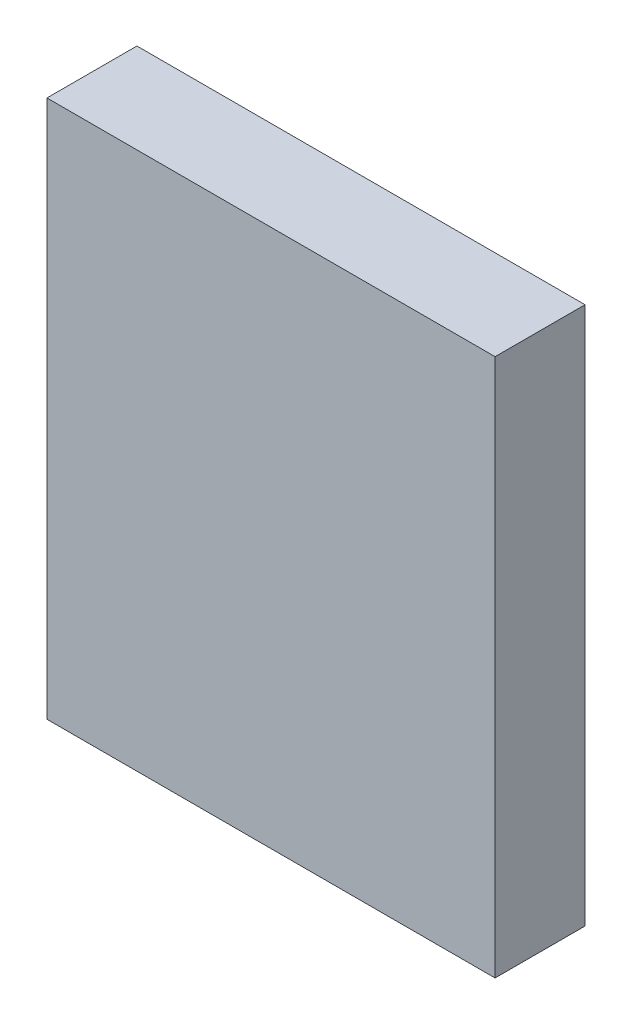
ISO-10303-21;
HEADER;
FILE_DESCRIPTION(('STEP AP214'),'2;1');
FILE_NAME('part.step','',(''),(''),'','','');
FILE_SCHEMA(('AUTOMOTIVE_DESIGN { 1 0 10303 214 1 1 1 1 }'));
ENDSEC;
DATA;
#1=APPLICATION_CONTEXT('core data for automotive mechanical design processes');
#2=APPLICATION_PROTOCOL_DEFINITION('international standard','automotive_design',2000,#1);
#3=PRODUCT_CONTEXT('',#1,'mechanical');
#4=PRODUCT('Part','Part','',(#3));
#5=PRODUCT_RELATED_PRODUCT_CATEGORY('part','',(#4));
#6=PRODUCT_DEFINITION_FORMATION('','',#4);
#7=PRODUCT_DEFINITION_CONTEXT('part definition',#1,'design');
#8=PRODUCT_DEFINITION('design','',#6,#7);
#9=PRODUCT_DEFINITION_SHAPE('','',#8);
#10=(LENGTH_UNIT() NAMED_UNIT(*) SI_UNIT(.MILLI.,.METRE.));
#11=(NAMED_UNIT(*) PLANE_ANGLE_UNIT() SI_UNIT($,.RADIAN.));
#12=(NAMED_UNIT(*) SI_UNIT($,.STERADIAN.) SOLID_ANGLE_UNIT());
#13=UNCERTAINTY_MEASURE_WITH_UNIT(LENGTH_MEASURE(1.E-05),#10,'distance_accuracy_value','');
#14=(GEOMETRIC_REPRESENTATION_CONTEXT(3) GLOBAL_UNCERTAINTY_ASSIGNED_CONTEXT((#13)) GLOBAL_UNIT_ASSIGNED_CONTEXT((#10,
#11,#12)) REPRESENTATION_CONTEXT('',''));
#15=CARTESIAN_POINT('',(0.,0.,0.));
#16=DIRECTION('',(0.,0.,1.));
#17=DIRECTION('',(1.,0.,0.));
#18=AXIS2_PLACEMENT_3D('',#15,#16,#17);
#19=CARTESIAN_POINT('',(-0.627,-1.003,0.));
#20=DIRECTION('',(0.,-1.,0.));
#21=DIRECTION('',(0.,0.,1.));
#22=AXIS2_PLACEMENT_3D('',#19,#20,#21);
#23=PLANE('',#22);
#24=DIRECTION('',(-1.,0.,0.));
#25=VECTOR('',#24,1.);
#26=CARTESIAN_POINT('',(-0.373,-1.003,0.));
#27=LINE('',#26,#25);
#28=CARTESIAN_POINT('',(-0.373,-1.003,0.));
#29=VERTEX_POINT('',#28);
#30=CARTESIAN_POINT('',(-0.627,-1.003,0.));
#31=VERTEX_POINT('',#30);
#32=EDGE_CURVE('E11',#29,#31,#27,.T.);
#33=ORIENTED_EDGE('',*,*,#32,.F.);
#34=DIRECTION('',(0.,0.,-1.));
#35=VECTOR('',#34,1.);
#36=CARTESIAN_POINT('',(-0.373,-1.003,0.051));
#37=LINE('',#36,#35);
#38=CARTESIAN_POINT('',(-0.373,-1.003,0.051));
#39=VERTEX_POINT('',#38);
#40=EDGE_CURVE('E24',#39,#29,#37,.T.);
#41=ORIENTED_EDGE('',*,*,#40,.F.);
#42=DIRECTION('',(1.,0.,0.));
#43=VECTOR('',#42,1.);
#44=CARTESIAN_POINT('',(-0.627,-1.003,0.051));
#45=LINE('',#44,#43);
#46=CARTESIAN_POINT('',(-0.627,-1.003,0.051));
#47=VERTEX_POINT('',#46);
#48=EDGE_CURVE('E88',#47,#39,#45,.T.);
#49=ORIENTED_EDGE('',*,*,#48,.F.);
#50=DIRECTION('',(0.,0.,1.));
#51=VECTOR('',#50,1.);
#52=CARTESIAN_POINT('',(-0.627,-1.003,0.));
#53=LINE('',#52,#51);
#54=EDGE_CURVE('E77',#31,#47,#53,.T.);
#55=ORIENTED_EDGE('',*,*,#54,.F.);
#56=EDGE_LOOP('',(#33,#41,#49,#55));
#57=FACE_BOUND('',#56,.T.);
#58=ADVANCED_FACE('F17',(#57),#23,.T.);
#59=CARTESIAN_POINT('',(-0.373,-1.003,0.));
#60=DIRECTION('',(1.,0.,0.));
#61=DIRECTION('',(0.,0.,1.));
#62=AXIS2_PLACEMENT_3D('',#59,#60,#61);
#63=PLANE('',#62);
#64=DIRECTION('',(0.,-1.,0.));
#65=VECTOR('',#64,1.);
#66=CARTESIAN_POINT('',(-0.373,-0.698,0.));
#67=LINE('',#66,#65);
#68=CARTESIAN_POINT('',(-0.373,-0.698,0.));
#69=VERTEX_POINT('',#68);
#70=EDGE_CURVE('E85',#69,#29,#67,.T.);
#71=ORIENTED_EDGE('',*,*,#70,.F.);
#72=DIRECTION('',(0.,0.,-1.));
#73=VECTOR('',#72,1.);
#74=CARTESIAN_POINT('',(-0.373,-0.698,0.051));
#75=LINE('',#74,#73);
#76=CARTESIAN_POINT('',(-0.373,-0.698,0.051));
#77=VERTEX_POINT('',#76);
#78=EDGE_CURVE('E83',#77,#69,#75,.T.);
#79=ORIENTED_EDGE('',*,*,#78,.F.);
#80=DIRECTION('',(0.,1.,0.));
#81=VECTOR('',#80,1.);
#82=CARTESIAN_POINT('',(-0.373,-1.003,0.051));
#83=LINE('',#82,#81);
#84=EDGE_CURVE('E72',#39,#77,#83,.T.);
#85=ORIENTED_EDGE('',*,*,#84,.F.);
#86=ORIENTED_EDGE('',*,*,#40,.T.);
#87=EDGE_LOOP('',(#71,#79,#85,#86));
#88=FACE_BOUND('',#87,.T.);
#89=ADVANCED_FACE('F90',(#88),#63,.T.);
#90=CARTESIAN_POINT('',(-0.373,-0.698,0.));
#91=DIRECTION('',(0.,1.,0.));
#92=DIRECTION('',(0.,0.,1.));
#93=AXIS2_PLACEMENT_3D('',#90,#91,#92);
#94=PLANE('',#93);
#95=DIRECTION('',(1.,0.,0.));
#96=VECTOR('',#95,1.);
#97=CARTESIAN_POINT('',(-0.627,-0.698,0.));
#98=LINE('',#97,#96);
#99=CARTESIAN_POINT('',(-0.627,-0.698,0.));
#100=VERTEX_POINT('',#99);
#101=EDGE_CURVE('E60',#100,#69,#98,.T.);
#102=ORIENTED_EDGE('',*,*,#101,.F.);
#103=DIRECTION('',(0.,0.,-1.));
#104=VECTOR('',#103,1.);
#105=CARTESIAN_POINT('',(-0.627,-0.698,0.051));
#106=LINE('',#105,#104);
#107=CARTESIAN_POINT('',(-0.627,-0.698,0.051));
#108=VERTEX_POINT('',#107);
#109=EDGE_CURVE('E54',#108,#100,#106,.T.);
#110=ORIENTED_EDGE('',*,*,#109,.F.);
#111=DIRECTION('',(-1.,0.,0.));
#112=VECTOR('',#111,1.);
#113=CARTESIAN_POINT('',(-0.373,-0.698,0.051));
#114=LINE('',#113,#112);
#115=EDGE_CURVE('E58',#77,#108,#114,.T.);
#116=ORIENTED_EDGE('',*,*,#115,.F.);
#117=ORIENTED_EDGE('',*,*,#78,.T.);
#118=EDGE_LOOP('',(#102,#110,#116,#117));
#119=FACE_BOUND('',#118,.T.);
#120=ADVANCED_FACE('F56',(#119),#94,.T.);
#121=CARTESIAN_POINT('',(-0.627,-0.698,0.));
#122=DIRECTION('',(-1.,0.,0.));
#123=DIRECTION('',(0.,0.,1.));
#124=AXIS2_PLACEMENT_3D('',#121,#122,#123);
#125=PLANE('',#124);
#126=DIRECTION('',(0.,1.,0.));
#127=VECTOR('',#126,1.);
#128=CARTESIAN_POINT('',(-0.627,-1.003,0.));
#129=LINE('',#128,#127);
#130=EDGE_CURVE('E73',#31,#100,#129,.T.);
#131=ORIENTED_EDGE('',*,*,#130,.F.);
#132=ORIENTED_EDGE('',*,*,#54,.T.);
#133=DIRECTION('',(0.,-1.,0.));
#134=VECTOR('',#133,1.);
#135=CARTESIAN_POINT('',(-0.627,-0.698,0.051));
#136=LINE('',#135,#134);
#137=EDGE_CURVE('E70',#108,#47,#136,.T.);
#138=ORIENTED_EDGE('',*,*,#137,.F.);
#139=ORIENTED_EDGE('',*,*,#109,.T.);
#140=EDGE_LOOP('',(#131,#132,#138,#139));
#141=FACE_BOUND('',#140,.T.);
#142=ADVANCED_FACE('F76',(#141),#125,.T.);
#143=CARTESIAN_POINT('',(-0.627,-0.698,0.));
#144=DIRECTION('',(0.,0.,-1.));
#145=DIRECTION('',(0.,1.,0.));
#146=AXIS2_PLACEMENT_3D('',#143,#144,#145);
#147=PLANE('',#146);
#148=ORIENTED_EDGE('',*,*,#101,.T.);
#149=ORIENTED_EDGE('',*,*,#70,.T.);
#150=ORIENTED_EDGE('',*,*,#32,.T.);
#151=ORIENTED_EDGE('',*,*,#130,.T.);
#152=EDGE_LOOP('',(#148,#149,#150,#151));
#153=FACE_BOUND('',#152,.T.);
#154=ADVANCED_FACE('F91',(#153),#147,.T.);
#155=CARTESIAN_POINT('',(-0.627,-1.003,0.051));
#156=DIRECTION('',(0.,0.,1.));
#157=DIRECTION('',(0.,1.,0.));
#158=AXIS2_PLACEMENT_3D('',#155,#156,#157);
#159=PLANE('',#158);
#160=ORIENTED_EDGE('',*,*,#48,.T.);
#161=ORIENTED_EDGE('',*,*,#84,.T.);
#162=ORIENTED_EDGE('',*,*,#115,.T.);
#163=ORIENTED_EDGE('',*,*,#137,.T.);
#164=EDGE_LOOP('',(#160,#161,#162,#163));
#165=FACE_BOUND('',#164,.T.);
#166=ADVANCED_FACE('F69',(#165),#159,.T.);
#167=CLOSED_SHELL('',(#58,#89,#120,#142,#154,#166));
#168=MANIFOLD_SOLID_BREP('B1',#167);
#169=ADVANCED_BREP_SHAPE_REPRESENTATION('',(#18,#168),#14);
#170=SHAPE_DEFINITION_REPRESENTATION(#9,#169);
ENDSEC;
END-ISO-10303-21;
